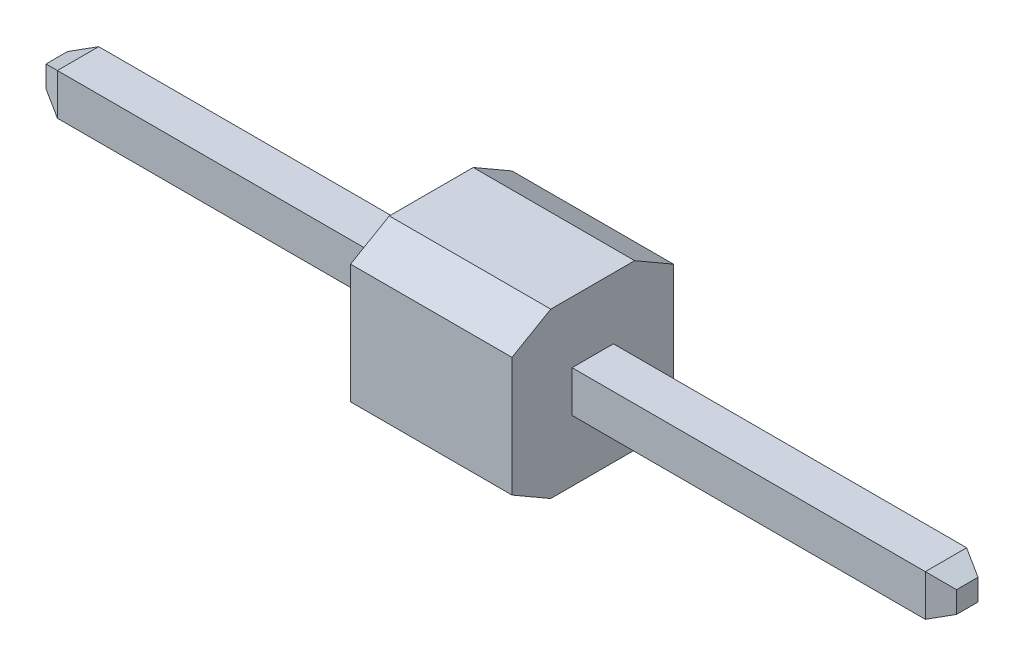
ISO-10303-21;
HEADER;
FILE_DESCRIPTION(('STEP AP214'),'2;1');
FILE_NAME('part.step','',(''),(''),'','','');
FILE_SCHEMA(('AUTOMOTIVE_DESIGN { 1 0 10303 214 1 1 1 1 }'));
ENDSEC;
DATA;
#1=APPLICATION_CONTEXT('core data for automotive mechanical design processes');
#2=APPLICATION_PROTOCOL_DEFINITION('international standard','automotive_design',2000,#1);
#3=PRODUCT_CONTEXT('',#1,'mechanical');
#4=PRODUCT('Part','Part','',(#3));
#5=PRODUCT_RELATED_PRODUCT_CATEGORY('part','',(#4));
#6=PRODUCT_DEFINITION_FORMATION('','',#4);
#7=PRODUCT_DEFINITION_CONTEXT('part definition',#1,'design');
#8=PRODUCT_DEFINITION('design','',#6,#7);
#9=PRODUCT_DEFINITION_SHAPE('','',#8);
#10=(LENGTH_UNIT() NAMED_UNIT(*) SI_UNIT(.MILLI.,.METRE.));
#11=(NAMED_UNIT(*) PLANE_ANGLE_UNIT() SI_UNIT($,.RADIAN.));
#12=(NAMED_UNIT(*) SI_UNIT($,.STERADIAN.) SOLID_ANGLE_UNIT());
#13=UNCERTAINTY_MEASURE_WITH_UNIT(LENGTH_MEASURE(1.E-05),#10,'distance_accuracy_value','');
#14=(GEOMETRIC_REPRESENTATION_CONTEXT(3) GLOBAL_UNCERTAINTY_ASSIGNED_CONTEXT((#13)) GLOBAL_UNIT_ASSIGNED_CONTEXT((#10,
#11,#12)) REPRESENTATION_CONTEXT('',''));
#15=CARTESIAN_POINT('',(0.,0.,0.));
#16=DIRECTION('',(0.,0.,1.));
#17=DIRECTION('',(1.,0.,0.));
#18=AXIS2_PLACEMENT_3D('',#15,#16,#17);
#19=CARTESIAN_POINT('',(5.42107666149886,10.4771157260571,-2.77112148378018));
#20=DIRECTION('',(1.,-9.93476518829084E-08,4.37113882867379E-08));
#21=DIRECTION('',(-9.93476589883358E-08,-1.,8.74227765734759E-08));
#22=AXIS2_PLACEMENT_3D('',#19,#20,#21);
#23=PLANE('',#22);
#24=DIRECTION('',(-1.18186619959584E-08,-0.50000007571054,-0.866025360072934));
#25=VECTOR('',#24,1.);
#26=CARTESIAN_POINT('',(5.42107646932425,9.23352602482091,-1.2011213750621));
#27=LINE('',#26,#25);
#28=CARTESIAN_POINT('',(5.42107646932425,9.23352602482091,-1.2011213750621));
#29=VERTEX_POINT('',#28);
#30=CARTESIAN_POINT('',(5.42107646113604,8.88711581085724,-1.80112134477796));
#31=VERTEX_POINT('',#30);
#32=EDGE_CURVE('E11',#29,#31,#27,.T.);
#33=ORIENTED_EDGE('',*,*,#32,.T.);
#34=DIRECTION('',(4.37113811813104E-08,-8.74227842254741E-08,-0.999999999999995));
#35=VECTOR('',#34,1.);
#36=CARTESIAN_POINT('',(5.42107646113604,8.88711581085724,-1.80112134477796));
#37=LINE('',#36,#35);
#38=CARTESIAN_POINT('',(5.42107651796084,8.88711569720762,-3.10112134477796));
#39=VERTEX_POINT('',#38);
#40=EDGE_CURVE('E304',#31,#39,#37,.T.);
#41=ORIENTED_EDGE('',*,*,#40,.T.);
#42=DIRECTION('',(8.75289950712042E-08,0.499999924289839,-0.866025447495712));
#43=VECTOR('',#42,1.);
#44=CARTESIAN_POINT('',(5.42107651796084,8.88711569720762,-3.10112134477796));
#45=LINE('',#44,#43);
#46=CARTESIAN_POINT('',(5.42107657860271,9.23352580626395,-3.7011213750621));
#47=VERTEX_POINT('',#46);
#48=EDGE_CURVE('E296',#39,#47,#45,.T.);
#49=ORIENTED_EDGE('',*,*,#48,.T.);
#50=DIRECTION('',(9.93476593244772E-08,0.999999999999991,-8.74227767226935E-08));
#51=VECTOR('',#50,1.);
#52=CARTESIAN_POINT('',(5.42107657860271,9.23352580626395,-3.7011213750621));
#53=LINE('',#52,#51);
#54=CARTESIAN_POINT('',(5.42107676211568,11.080705483234,-3.70112153654768));
#55=VERTEX_POINT('',#54);
#56=EDGE_CURVE('E281',#47,#55,#53,.T.);
#57=ORIENTED_EDGE('',*,*,#56,.T.);
#58=DIRECTION('',(-1.18186619958732E-08,-0.500000075710534,-0.866025360072937));
#59=VECTOR('',#58,1.);
#60=CARTESIAN_POINT('',(5.42107677030389,11.4271156972076,-3.10112156683181));
#61=LINE('',#60,#59);
#62=CARTESIAN_POINT('',(5.42107677030389,11.4271156972076,-3.10112156683181));
#63=VERTEX_POINT('',#62);
#64=EDGE_CURVE('E265',#63,#55,#61,.T.);
#65=ORIENTED_EDGE('',*,*,#64,.F.);
#66=DIRECTION('',(4.37113811813104E-08,-8.74227842254741E-08,-0.999999999999995));
#67=VECTOR('',#66,1.);
#68=CARTESIAN_POINT('',(5.4210767134791,11.4271158108572,-1.80112156683181));
#69=LINE('',#68,#67);
#70=CARTESIAN_POINT('',(5.4210767134791,11.4271158108572,-1.80112156683181));
#71=VERTEX_POINT('',#70);
#72=EDGE_CURVE('E248',#71,#63,#69,.T.);
#73=ORIENTED_EDGE('',*,*,#72,.F.);
#74=DIRECTION('',(8.7528995070573E-08,0.499999924289833,-0.866025447495715));
#75=VECTOR('',#74,1.);
#76=CARTESIAN_POINT('',(5.42107665283723,11.0807057017909,-1.20112153654768));
#77=LINE('',#76,#75);
#78=CARTESIAN_POINT('',(5.42107665283723,11.0807057017909,-1.20112153654768));
#79=VERTEX_POINT('',#78);
#80=EDGE_CURVE('E242',#79,#71,#77,.T.);
#81=ORIENTED_EDGE('',*,*,#80,.F.);
#82=DIRECTION('',(9.93476593244772E-08,0.999999999999991,-8.74227763620714E-08));
#83=VECTOR('',#82,1.);
#84=CARTESIAN_POINT('',(5.42107646932425,9.23352602482091,-1.2011213750621));
#85=LINE('',#84,#83);
#86=EDGE_CURVE('E236',#29,#79,#85,.T.);
#87=ORIENTED_EDGE('',*,*,#86,.F.);
#88=EDGE_LOOP('',(#33,#41,#49,#57,#65,#73,#81,#87));
#89=FACE_BOUND('',#88,.T.);
#90=DIRECTION('',(-4.37113803486431E-08,8.74227856773043E-08,0.999999999999995));
#91=VECTOR('',#90,1.);
#92=CARTESIAN_POINT('',(5.42107659791636,9.83711572605714,-2.7711214278296));
#93=LINE('',#92,#91);
#94=CARTESIAN_POINT('',(5.42107659791636,9.83711572605714,-2.7711214278296));
#95=VERTEX_POINT('',#94);
#96=CARTESIAN_POINT('',(5.42107656994108,9.83711578200772,-2.1311214278296));
#97=VERTEX_POINT('',#96);
#98=EDGE_CURVE('E302',#95,#97,#93,.T.);
#99=ORIENTED_EDGE('',*,*,#98,.T.);
#100=DIRECTION('',(-9.93476592658906E-08,-0.999999999999991,8.74227759628524E-08));
#101=VECTOR('',#100,1.);
#102=CARTESIAN_POINT('',(5.42107663352358,10.4771157820077,-2.13112148378018));
#103=LINE('',#102,#101);
#104=CARTESIAN_POINT('',(5.42107663352358,10.4771157820077,-2.13112148378018));
#105=VERTEX_POINT('',#104);
#106=EDGE_CURVE('E293',#105,#97,#103,.T.);
#107=ORIENTED_EDGE('',*,*,#106,.F.);
#108=DIRECTION('',(-4.37113803486431E-08,8.74227856773042E-08,0.999999999999995));
#109=VECTOR('',#108,1.);
#110=CARTESIAN_POINT('',(5.42107666149886,10.4771157260571,-2.77112148378018));
#111=LINE('',#110,#109);
#112=CARTESIAN_POINT('',(5.42107666149886,10.4771157260571,-2.77112148378018));
#113=VERTEX_POINT('',#112);
#114=EDGE_CURVE('E278',#113,#105,#111,.T.);
#115=ORIENTED_EDGE('',*,*,#114,.F.);
#116=DIRECTION('',(-9.93476592658906E-08,-0.999999999999991,8.74227766567418E-08));
#117=VECTOR('',#116,1.);
#118=CARTESIAN_POINT('',(5.42107666149886,10.4771157260571,-2.77112148378018));
#119=LINE('',#118,#117);
#120=EDGE_CURVE('E263',#113,#95,#119,.T.);
#121=ORIENTED_EDGE('',*,*,#120,.T.);
#122=EDGE_LOOP('',(#99,#107,#115,#121));
#123=FACE_BOUND('',#122,.T.);
#124=ADVANCED_FACE('F17',(#89,#123),#23,.T.);
#125=CARTESIAN_POINT('',(2.92107666149886,10.4771159744263,-2.77112159305865));
#126=DIRECTION('',(1.,-9.93476518829084E-08,4.37113882867379E-08));
#127=DIRECTION('',(-9.93476589883358E-08,-1.,8.74227765734759E-08));
#128=AXIS2_PLACEMENT_3D('',#125,#126,#127);
#129=PLANE('',#128);
#130=DIRECTION('',(-1.18186632779335E-08,-0.50000007571054,-0.866025360072934));
#131=VECTOR('',#130,1.);
#132=CARTESIAN_POINT('',(2.92107646932425,9.23352627319004,-1.20112148434057));
#133=LINE('',#132,#131);
#134=CARTESIAN_POINT('',(2.92107646932425,9.23352627319004,-1.20112148434057));
#135=VERTEX_POINT('',#134);
#136=CARTESIAN_POINT('',(2.92107646113604,8.88711605922637,-1.80112145405643));
#137=VERTEX_POINT('',#136);
#138=EDGE_CURVE('E24',#135,#137,#133,.T.);
#139=ORIENTED_EDGE('',*,*,#138,.F.);
#140=DIRECTION('',(9.93476588436478E-08,0.999999999999991,-8.74227763620714E-08));
#141=VECTOR('',#140,1.);
#142=CARTESIAN_POINT('',(2.92107646932425,9.23352627319004,-1.20112148434057));
#143=LINE('',#142,#141);
#144=CARTESIAN_POINT('',(2.92107665283723,11.08070595016,-1.20112164582615));
#145=VERTEX_POINT('',#144);
#146=EDGE_CURVE('E300',#135,#145,#143,.T.);
#147=ORIENTED_EDGE('',*,*,#146,.T.);
#148=DIRECTION('',(8.75289963525482E-08,0.499999924289833,-0.866025447495715));
#149=VECTOR('',#148,1.);
#150=CARTESIAN_POINT('',(2.92107665283723,11.08070595016,-1.20112164582615));
#151=LINE('',#150,#149);
#152=CARTESIAN_POINT('',(2.9210767134791,11.4271160592264,-1.80112167611028));
#153=VERTEX_POINT('',#152);
#154=EDGE_CURVE('E286',#145,#153,#151,.T.);
#155=ORIENTED_EDGE('',*,*,#154,.T.);
#156=DIRECTION('',(4.37113811813104E-08,-8.74227842254741E-08,-0.999999999999995));
#157=VECTOR('',#156,1.);
#158=CARTESIAN_POINT('',(2.9210767134791,11.4271160592264,-1.80112167611028));
#159=LINE('',#158,#157);
#160=CARTESIAN_POINT('',(2.92107677030389,11.4271159455767,-3.10112167611028));
#161=VERTEX_POINT('',#160);
#162=EDGE_CURVE('E271',#153,#161,#159,.T.);
#163=ORIENTED_EDGE('',*,*,#162,.T.);
#164=DIRECTION('',(-1.18186632778483E-08,-0.500000075710534,-0.866025360072937));
#165=VECTOR('',#164,1.);
#166=CARTESIAN_POINT('',(2.92107677030389,11.4271159455767,-3.10112167611028));
#167=LINE('',#166,#165);
#168=CARTESIAN_POINT('',(2.92107676211568,11.0807057316031,-3.70112164582615));
#169=VERTEX_POINT('',#168);
#170=EDGE_CURVE('E253',#161,#169,#167,.T.);
#171=ORIENTED_EDGE('',*,*,#170,.T.);
#172=DIRECTION('',(9.93476588436478E-08,0.999999999999991,-8.74227767226935E-08));
#173=VECTOR('',#172,1.);
#174=CARTESIAN_POINT('',(2.92107657860271,9.23352605463308,-3.70112148434057));
#175=LINE('',#174,#173);
#176=CARTESIAN_POINT('',(2.92107657860271,9.23352605463308,-3.70112148434057));
#177=VERTEX_POINT('',#176);
#178=EDGE_CURVE('E261',#177,#169,#175,.T.);
#179=ORIENTED_EDGE('',*,*,#178,.F.);
#180=DIRECTION('',(8.75289963531793E-08,0.499999924289839,-0.866025447495712));
#181=VECTOR('',#180,1.);
#182=CARTESIAN_POINT('',(2.92107651796084,8.88711594557675,-3.10112145405643));
#183=LINE('',#182,#181);
#184=CARTESIAN_POINT('',(2.92107651796084,8.88711594557675,-3.10112145405643));
#185=VERTEX_POINT('',#184);
#186=EDGE_CURVE('E276',#185,#177,#183,.T.);
#187=ORIENTED_EDGE('',*,*,#186,.F.);
#188=DIRECTION('',(4.37113811813104E-08,-8.74227842254741E-08,-0.999999999999995));
#189=VECTOR('',#188,1.);
#190=CARTESIAN_POINT('',(2.92107646113604,8.88711605922637,-1.80112145405643));
#191=LINE('',#190,#189);
#192=EDGE_CURVE('E291',#137,#185,#191,.T.);
#193=ORIENTED_EDGE('',*,*,#192,.F.);
#194=EDGE_LOOP('',(#139,#147,#155,#163,#171,#179,#187,#193));
#195=FACE_BOUND('',#194,.T.);
#196=DIRECTION('',(-9.93476585720012E-08,-0.999999999999991,8.74227759628524E-08));
#197=VECTOR('',#196,1.);
#198=CARTESIAN_POINT('',(2.92107663352358,10.4771160303769,-2.13112159305865));
#199=LINE('',#198,#197);
#200=CARTESIAN_POINT('',(2.92107663352358,10.4771160303769,-2.13112159305865));
#201=VERTEX_POINT('',#200);
#202=CARTESIAN_POINT('',(2.92107656994108,9.83711603037685,-2.13112153710807));
#203=VERTEX_POINT('',#202);
#204=EDGE_CURVE('E298',#201,#203,#199,.T.);
#205=ORIENTED_EDGE('',*,*,#204,.T.);
#206=DIRECTION('',(-4.37113810425325E-08,8.74227856773043E-08,0.999999999999995));
#207=VECTOR('',#206,1.);
#208=CARTESIAN_POINT('',(2.92107659791636,9.83711597442627,-2.77112153710807));
#209=LINE('',#208,#207);
#210=CARTESIAN_POINT('',(2.92107659791636,9.83711597442627,-2.77112153710807));
#211=VERTEX_POINT('',#210);
#212=EDGE_CURVE('E283',#211,#203,#209,.T.);
#213=ORIENTED_EDGE('',*,*,#212,.F.);
#214=DIRECTION('',(-9.93476585720012E-08,-0.999999999999991,8.74227766567418E-08));
#215=VECTOR('',#214,1.);
#216=CARTESIAN_POINT('',(2.92107666149886,10.4771159744263,-2.77112159305865));
#217=LINE('',#216,#215);
#218=CARTESIAN_POINT('',(2.92107666149886,10.4771159744263,-2.77112159305865));
#219=VERTEX_POINT('',#218);
#220=EDGE_CURVE('E268',#219,#211,#217,.T.);
#221=ORIENTED_EDGE('',*,*,#220,.F.);
#222=DIRECTION('',(-4.37113810425325E-08,8.74227856773042E-08,0.999999999999995));
#223=VECTOR('',#222,1.);
#224=CARTESIAN_POINT('',(2.92107666149886,10.4771159744263,-2.77112159305865));
#225=LINE('',#224,#223);
#226=EDGE_CURVE('E251',#219,#201,#225,.T.);
#227=ORIENTED_EDGE('',*,*,#226,.T.);
#228=EDGE_LOOP('',(#205,#213,#221,#227));
#229=FACE_BOUND('',#228,.T.);
#230=ADVANCED_FACE('F314',(#195,#229),#129,.F.);
#231=CARTESIAN_POINT('',(5.42107646932425,9.23352602482091,-1.2011213750621));
#232=DIRECTION('',(1.07893287081065E-07,0.866025360072937,-0.500000075710535));
#233=DIRECTION('',(1.18186629566715E-08,0.500000075710542,0.866025360072941));
#234=AXIS2_PLACEMENT_3D('',#231,#232,#233);
#235=PLANE('',#234);
#236=ORIENTED_EDGE('',*,*,#138,.T.);
#237=DIRECTION('',(-0.999999999999994,9.93476504618223E-08,-4.37113884643734E-08));
#238=VECTOR('',#237,1.);
#239=CARTESIAN_POINT('',(5.42107646113604,8.88711581085724,-1.80112134477796));
#240=LINE('',#239,#238);
#241=EDGE_CURVE('E288',#31,#137,#240,.T.);
#242=ORIENTED_EDGE('',*,*,#241,.F.);
#243=ORIENTED_EDGE('',*,*,#32,.F.);
#244=DIRECTION('',(-0.999999999999994,9.93476533039933E-08,-4.3711388109102E-08));
#245=VECTOR('',#244,1.);
#246=CARTESIAN_POINT('',(5.42107646932425,9.23352602482091,-1.2011213750621));
#247=LINE('',#246,#245);
#248=EDGE_CURVE('E256',#29,#135,#247,.T.);
#249=ORIENTED_EDGE('',*,*,#248,.T.);
#250=EDGE_LOOP('',(#236,#242,#243,#249));
#251=FACE_BOUND('',#250,.T.);
#252=ADVANCED_FACE('F306',(#251),#235,.F.);
#253=CARTESIAN_POINT('',(5.42107646113604,8.88711581085724,-1.80112134477796));
#254=DIRECTION('',(9.93476589883358E-08,1.,-8.74227765734759E-08));
#255=DIRECTION('',(1.,-9.93476518829084E-08,4.37113882867379E-08));
#256=AXIS2_PLACEMENT_3D('',#253,#254,#255);
#257=PLANE('',#256);
#258=ORIENTED_EDGE('',*,*,#192,.T.);
#259=DIRECTION('',(-0.999999999999994,9.93476504618223E-08,-4.37113882867377E-08));
#260=VECTOR('',#259,1.);
#261=CARTESIAN_POINT('',(5.42107651796084,8.88711569720762,-3.10112134477796));
#262=LINE('',#261,#260);
#263=EDGE_CURVE('E273',#39,#185,#262,.T.);
#264=ORIENTED_EDGE('',*,*,#263,.F.);
#265=ORIENTED_EDGE('',*,*,#40,.F.);
#266=ORIENTED_EDGE('',*,*,#241,.T.);
#267=EDGE_LOOP('',(#258,#264,#265,#266));
#268=FACE_BOUND('',#267,.T.);
#269=ADVANCED_FACE('F311',(#268),#257,.F.);
#270=CARTESIAN_POINT('',(5.42107651796084,8.88711569720762,-3.10112134477796));
#271=DIRECTION('',(6.41819058997377E-08,0.866025447495721,0.499999924289845));
#272=DIRECTION('',(-8.7528996031702E-08,-0.499999924289838,0.866025447495717));
#273=AXIS2_PLACEMENT_3D('',#270,#271,#272);
#274=PLANE('',#273);
#275=ORIENTED_EDGE('',*,*,#186,.T.);
#276=DIRECTION('',(-0.999999999999994,9.93476533039933E-08,-4.37113884643734E-08));
#277=VECTOR('',#276,1.);
#278=CARTESIAN_POINT('',(5.42107657860271,9.23352580626395,-3.7011213750621));
#279=LINE('',#278,#277);
#280=EDGE_CURVE('E258',#47,#177,#279,.T.);
#281=ORIENTED_EDGE('',*,*,#280,.F.);
#282=ORIENTED_EDGE('',*,*,#48,.F.);
#283=ORIENTED_EDGE('',*,*,#263,.T.);
#284=EDGE_LOOP('',(#275,#281,#282,#283));
#285=FACE_BOUND('',#284,.T.);
#286=ADVANCED_FACE('F319',(#285),#274,.F.);
#287=CARTESIAN_POINT('',(5.42107657860271,9.23352580626395,-3.7011213750621));
#288=DIRECTION('',(-4.37113811813106E-08,8.74227836789032E-08,1.));
#289=DIRECTION('',(-1.,9.93476518829084E-08,-4.37113882867379E-08));
#290=AXIS2_PLACEMENT_3D('',#287,#288,#289);
#291=PLANE('',#290);
#292=ORIENTED_EDGE('',*,*,#178,.T.);
#293=DIRECTION('',(-0.999999999999994,9.93476533039933E-08,-4.37113882867377E-08));
#294=VECTOR('',#293,1.);
#295=CARTESIAN_POINT('',(5.42107676211568,11.080705483234,-3.70112153654768));
#296=LINE('',#295,#294);
#297=EDGE_CURVE('E245',#55,#169,#296,.T.);
#298=ORIENTED_EDGE('',*,*,#297,.F.);
#299=ORIENTED_EDGE('',*,*,#56,.F.);
#300=ORIENTED_EDGE('',*,*,#280,.T.);
#301=EDGE_LOOP('',(#292,#298,#299,#300));
#302=FACE_BOUND('',#301,.T.);
#303=ADVANCED_FACE('F326',(#302),#291,.F.);
#304=CARTESIAN_POINT('',(5.42107677030389,11.4271156972076,-3.10112156683181));
#305=DIRECTION('',(1.07893287081065E-07,0.866025360072937,-0.500000075710535));
#306=DIRECTION('',(1.18186629566715E-08,0.500000075710542,0.866025360072941));
#307=AXIS2_PLACEMENT_3D('',#304,#305,#306);
#308=PLANE('',#307);
#309=ORIENTED_EDGE('',*,*,#170,.F.);
#310=DIRECTION('',(-0.999999999999994,9.93476533039933E-08,-4.37113884643734E-08));
#311=VECTOR('',#310,1.);
#312=CARTESIAN_POINT('',(5.42107677030389,11.4271156972076,-3.10112156683181));
#313=LINE('',#312,#311);
#314=EDGE_CURVE('E239',#63,#161,#313,.T.);
#315=ORIENTED_EDGE('',*,*,#314,.F.);
#316=ORIENTED_EDGE('',*,*,#64,.T.);
#317=ORIENTED_EDGE('',*,*,#297,.T.);
#318=EDGE_LOOP('',(#309,#315,#316,#317));
#319=FACE_BOUND('',#318,.T.);
#320=ADVANCED_FACE('F329',(#319),#308,.T.);
#321=CARTESIAN_POINT('',(5.4210767134791,11.4271158108572,-1.80112156683181));
#322=DIRECTION('',(9.93476589883358E-08,1.,-8.74227765734759E-08));
#323=DIRECTION('',(1.,-9.93476518829084E-08,4.37113882867379E-08));
#324=AXIS2_PLACEMENT_3D('',#321,#322,#323);
#325=PLANE('',#324);
#326=ORIENTED_EDGE('',*,*,#162,.F.);
#327=DIRECTION('',(-0.999999999999994,9.93476533039933E-08,-4.37113883755555E-08));
#328=VECTOR('',#327,1.);
#329=CARTESIAN_POINT('',(5.4210767134791,11.4271158108572,-1.80112156683181));
#330=LINE('',#329,#328);
#331=EDGE_CURVE('E233',#71,#153,#330,.T.);
#332=ORIENTED_EDGE('',*,*,#331,.F.);
#333=ORIENTED_EDGE('',*,*,#72,.T.);
#334=ORIENTED_EDGE('',*,*,#314,.T.);
#335=EDGE_LOOP('',(#326,#332,#333,#334));
#336=FACE_BOUND('',#335,.T.);
#337=ADVANCED_FACE('F333',(#336),#325,.T.);
#338=CARTESIAN_POINT('',(5.42107665283723,11.0807057017909,-1.20112153654768));
#339=DIRECTION('',(6.41819058997377E-08,0.866025447495721,0.499999924289845));
#340=DIRECTION('',(-8.7528996031702E-08,-0.499999924289838,0.866025447495717));
#341=AXIS2_PLACEMENT_3D('',#338,#339,#340);
#342=PLANE('',#341);
#343=ORIENTED_EDGE('',*,*,#154,.F.);
#344=DIRECTION('',(-0.999999999999994,9.93476533039933E-08,-4.3711388109102E-08));
#345=VECTOR('',#344,1.);
#346=CARTESIAN_POINT('',(5.42107665283723,11.0807057017909,-1.20112153654768));
#347=LINE('',#346,#345);
#348=EDGE_CURVE('E230',#79,#145,#347,.T.);
#349=ORIENTED_EDGE('',*,*,#348,.F.);
#350=ORIENTED_EDGE('',*,*,#80,.T.);
#351=ORIENTED_EDGE('',*,*,#331,.T.);
#352=EDGE_LOOP('',(#343,#349,#350,#351));
#353=FACE_BOUND('',#352,.T.);
#354=ADVANCED_FACE('F337',(#353),#342,.T.);
#355=CARTESIAN_POINT('',(5.42107646932425,9.23352602482091,-1.2011213750621));
#356=DIRECTION('',(-4.37113811813106E-08,8.74227835615132E-08,1.));
#357=DIRECTION('',(-9.93476589883358E-08,-1.,8.74227764560859E-08));
#358=AXIS2_PLACEMENT_3D('',#355,#356,#357);
#359=PLANE('',#358);
#360=ORIENTED_EDGE('',*,*,#146,.F.);
#361=ORIENTED_EDGE('',*,*,#248,.F.);
#362=ORIENTED_EDGE('',*,*,#86,.T.);
#363=ORIENTED_EDGE('',*,*,#348,.T.);
#364=EDGE_LOOP('',(#360,#361,#362,#363));
#365=FACE_BOUND('',#364,.T.);
#366=ADVANCED_FACE('F339',(#365),#359,.T.);
#367=CARTESIAN_POINT('',(-2.87892333850114,10.4771165506426,-2.7711218465847));
#368=DIRECTION('',(-1.,9.93476518829084E-08,-4.37113882867379E-08));
#369=DIRECTION('',(9.93476589883358E-08,1.,-8.74227765734759E-08));
#370=AXIS2_PLACEMENT_3D('',#367,#368,#369);
#371=PLANE('',#370);
#372=DIRECTION('',(9.93476608211201E-08,0.999999999999991,-8.74227774781761E-08));
#373=VECTOR('',#372,1.);
#374=CARTESIAN_POINT('',(-2.87892340804478,9.99099812033048,-2.28500333127787));
#375=LINE('',#374,#373);
#376=CARTESIAN_POINT('',(-2.87892340804478,9.99099812033048,-2.28500333127787));
#377=VERTEX_POINT('',#376);
#378=CARTESIAN_POINT('',(-2.87892337503782,10.3232350659405,-2.28500336032295));
#379=VERTEX_POINT('',#378);
#380=EDGE_CURVE('E228',#377,#379,#375,.T.);
#381=ORIENTED_EDGE('',*,*,#380,.T.);
#382=DIRECTION('',(4.37113820547149E-08,-8.7422774802743E-08,-0.999999999999995));
#383=VECTOR('',#382,1.);
#384=CARTESIAN_POINT('',(-2.87892337503782,10.3232350659405,-2.28500336032295));
#385=LINE('',#384,#383);
#386=CARTESIAN_POINT('',(-2.87892336051528,10.3232350368954,-2.61724030594095));
#387=VERTEX_POINT('',#386);
#388=EDGE_CURVE('E223',#379,#387,#385,.T.);
#389=ORIENTED_EDGE('',*,*,#388,.T.);
#390=DIRECTION('',(-9.93476608211201E-08,-0.999999999999991,8.7422776141512E-08));
#391=VECTOR('',#390,1.);
#392=CARTESIAN_POINT('',(-2.87892336051528,10.3232350368954,-2.61724030594095));
#393=LINE('',#392,#391);
#394=CARTESIAN_POINT('',(-2.87892339352224,9.9909980912854,-2.61724027689587));
#395=VERTEX_POINT('',#394);
#396=EDGE_CURVE('E215',#387,#395,#393,.T.);
#397=ORIENTED_EDGE('',*,*,#396,.T.);
#398=DIRECTION('',(-4.37113767080583E-08,8.74227854960559E-08,0.999999999999995));
#399=VECTOR('',#398,1.);
#400=CARTESIAN_POINT('',(-2.87892339352225,9.9909980912854,-2.61724027689587));
#401=LINE('',#400,#399);
#402=EDGE_CURVE('E207',#395,#377,#401,.T.);
#403=ORIENTED_EDGE('',*,*,#402,.T.);
#404=EDGE_LOOP('',(#381,#389,#397,#403));
#405=FACE_BOUND('',#404,.T.);
#406=ADVANCED_FACE('F341',(#405),#371,.T.);
#407=CARTESIAN_POINT('',(-2.87892333850114,10.4771165506426,-2.7711218465847));
#408=DIRECTION('',(9.93476589883358E-08,1.,-8.74227764510112E-08));
#409=DIRECTION('',(-4.37113811813106E-08,8.74227835564385E-08,1.));
#410=AXIS2_PLACEMENT_3D('',#407,#408,#409);
#411=PLANE('',#410);
#412=DIRECTION('',(0.999999999999994,-9.93476521037346E-08,4.37113882769953E-08));
#413=VECTOR('',#412,1.);
#414=CARTESIAN_POINT('',(-2.54892333850114,10.4771165178579,-2.77112183215994));
#415=LINE('',#414,#413);
#416=CARTESIAN_POINT('',(-2.54892333850114,10.4771165178579,-2.77112183215994));
#417=VERTEX_POINT('',#416);
#418=EDGE_CURVE('E225',#417,#219,#415,.T.);
#419=ORIENTED_EDGE('',*,*,#418,.F.);
#420=DIRECTION('',(-4.37113803486431E-08,8.74227856773042E-08,0.999999999999995));
#421=VECTOR('',#420,1.);
#422=CARTESIAN_POINT('',(-2.54892333850114,10.4771165178579,-2.77112183215994));
#423=LINE('',#422,#421);
#424=CARTESIAN_POINT('',(-2.54892336647642,10.4771165738085,-2.13112183215994));
#425=VERTEX_POINT('',#424);
#426=EDGE_CURVE('E217',#417,#425,#423,.T.);
#427=ORIENTED_EDGE('',*,*,#426,.T.);
#428=DIRECTION('',(0.999999999999994,-9.93476521037346E-08,4.3711388195809E-08));
#429=VECTOR('',#428,1.);
#430=CARTESIAN_POINT('',(-2.54892336647642,10.4771165738085,-2.13112183215994));
#431=LINE('',#430,#429);
#432=EDGE_CURVE('E220',#425,#201,#431,.T.);
#433=ORIENTED_EDGE('',*,*,#432,.T.);
#434=ORIENTED_EDGE('',*,*,#226,.F.);
#435=EDGE_LOOP('',(#419,#427,#433,#434));
#436=FACE_BOUND('',#435,.T.);
#437=ADVANCED_FACE('F348',(#436),#411,.T.);
#438=CARTESIAN_POINT('',(-2.87892336647642,10.4771166065932,-2.1311218465847));
#439=DIRECTION('',(-4.37113811813106E-08,8.74227836789032E-08,1.));
#440=DIRECTION('',(-1.,9.93476518829084E-08,-4.37113882867379E-08));
#441=AXIS2_PLACEMENT_3D('',#438,#439,#440);
#442=PLANE('',#441);
#443=ORIENTED_EDGE('',*,*,#432,.F.);
#444=DIRECTION('',(-9.93476592658906E-08,-0.999999999999991,8.74227766567418E-08));
#445=VECTOR('',#444,1.);
#446=CARTESIAN_POINT('',(-2.54892336647642,10.4771165738085,-2.13112183215994));
#447=LINE('',#446,#445);
#448=CARTESIAN_POINT('',(-2.54892343005892,9.83711657380851,-2.13112177620936));
#449=VERTEX_POINT('',#448);
#450=EDGE_CURVE('E209',#425,#449,#447,.T.);
#451=ORIENTED_EDGE('',*,*,#450,.T.);
#452=DIRECTION('',(0.999999999999994,-9.93476547016971E-08,4.3711388195809E-08));
#453=VECTOR('',#452,1.);
#454=CARTESIAN_POINT('',(-2.54892343005892,9.83711657380851,-2.13112177620936));
#455=LINE('',#454,#453);
#456=EDGE_CURVE('E212',#449,#203,#455,.T.);
#457=ORIENTED_EDGE('',*,*,#456,.T.);
#458=ORIENTED_EDGE('',*,*,#204,.F.);
#459=EDGE_LOOP('',(#443,#451,#457,#458));
#460=FACE_BOUND('',#459,.T.);
#461=ADVANCED_FACE('F424',(#460),#442,.T.);
#462=CARTESIAN_POINT('',(-2.87892340208364,9.83711655064265,-2.77112179063412));
#463=DIRECTION('',(9.93476589883357E-08,1.,-8.74227764040693E-08));
#464=DIRECTION('',(-4.37113811813106E-08,8.74227835094966E-08,1.));
#465=AXIS2_PLACEMENT_3D('',#462,#463,#464);
#466=PLANE('',#465);
#467=ORIENTED_EDGE('',*,*,#456,.F.);
#468=DIRECTION('',(4.37113817364219E-08,-8.74227967795345E-08,-0.999999999999995));
#469=VECTOR('',#468,1.);
#470=CARTESIAN_POINT('',(-2.54892343005892,9.83711657380852,-2.13112177620936));
#471=LINE('',#470,#469);
#472=CARTESIAN_POINT('',(-2.54892340208364,9.83711651785792,-2.77112177620936));
#473=VERTEX_POINT('',#472);
#474=EDGE_CURVE('E201',#449,#473,#471,.T.);
#475=ORIENTED_EDGE('',*,*,#474,.T.);
#476=DIRECTION('',(0.999999999999994,-9.93476547016971E-08,4.37113882769953E-08));
#477=VECTOR('',#476,1.);
#478=CARTESIAN_POINT('',(-2.54892340208364,9.83711651785792,-2.77112177620936));
#479=LINE('',#478,#477);
#480=EDGE_CURVE('E204',#473,#211,#479,.T.);
#481=ORIENTED_EDGE('',*,*,#480,.T.);
#482=ORIENTED_EDGE('',*,*,#212,.T.);
#483=EDGE_LOOP('',(#467,#475,#481,#482));
#484=FACE_BOUND('',#483,.T.);
#485=ADVANCED_FACE('F421',(#484),#466,.F.);
#486=CARTESIAN_POINT('',(-2.87892333850114,10.4771165506426,-2.7711218465847));
#487=DIRECTION('',(-4.37113811813106E-08,8.74227836789032E-08,1.));
#488=DIRECTION('',(-1.,9.93476518829084E-08,-4.37113882867379E-08));
#489=AXIS2_PLACEMENT_3D('',#486,#487,#488);
#490=PLANE('',#489);
#491=ORIENTED_EDGE('',*,*,#480,.F.);
#492=DIRECTION('',(9.93476578781123E-08,0.999999999999991,-8.74227766567422E-08));
#493=VECTOR('',#492,1.);
#494=CARTESIAN_POINT('',(-2.54892340208364,9.83711651785793,-2.77112177620936));
#495=LINE('',#494,#493);
#496=EDGE_CURVE('E196',#473,#417,#495,.T.);
#497=ORIENTED_EDGE('',*,*,#496,.T.);
#498=ORIENTED_EDGE('',*,*,#418,.T.);
#499=ORIENTED_EDGE('',*,*,#220,.T.);
#500=EDGE_LOOP('',(#491,#497,#498,#499));
#501=FACE_BOUND('',#500,.T.);
#502=ADVANCED_FACE('F376',(#501),#490,.F.);
#503=CARTESIAN_POINT('',(-2.87892333850114,10.4771165506426,-2.7711218465847));
#504=DIRECTION('',(-4.37113811813106E-08,8.74227836789032E-08,1.));
#505=DIRECTION('',(-1.,9.93476518829084E-08,-4.37113882867379E-08));
#506=AXIS2_PLACEMENT_3D('',#503,#504,#505);
#507=PLANE('',#506);
#508=DIRECTION('',(0.999999999999994,-9.93476469078097E-08,4.37113882769953E-08));
#509=VECTOR('',#508,1.);
#510=CARTESIAN_POINT('',(5.42107666149886,10.4771157260571,-2.77112148378018));
#511=LINE('',#510,#509);
#512=CARTESIAN_POINT('',(10.8910766614989,10.4771151826255,-2.77112124467888));
#513=VERTEX_POINT('',#512);
#514=EDGE_CURVE('E199',#113,#513,#511,.T.);
#515=ORIENTED_EDGE('',*,*,#514,.T.);
#516=DIRECTION('',(-9.93476606536693E-08,-0.999999999999991,8.74227766567418E-08));
#517=VECTOR('',#516,1.);
#518=CARTESIAN_POINT('',(10.8910766614989,10.4771151826255,-2.77112124467888));
#519=LINE('',#518,#517);
#520=CARTESIAN_POINT('',(10.8910765979164,9.83711518262548,-2.77112118872831));
#521=VERTEX_POINT('',#520);
#522=EDGE_CURVE('E191',#513,#521,#519,.T.);
#523=ORIENTED_EDGE('',*,*,#522,.T.);
#524=DIRECTION('',(0.999999999999994,-9.93476572996596E-08,4.37113882769953E-08));
#525=VECTOR('',#524,1.);
#526=CARTESIAN_POINT('',(5.42107659791636,9.83711572605714,-2.7711214278296));
#527=LINE('',#526,#525);
#528=EDGE_CURVE('E194',#95,#521,#527,.T.);
#529=ORIENTED_EDGE('',*,*,#528,.F.);
#530=ORIENTED_EDGE('',*,*,#120,.F.);
#531=EDGE_LOOP('',(#515,#523,#529,#530));
#532=FACE_BOUND('',#531,.T.);
#533=ADVANCED_FACE('F367',(#532),#507,.F.);
#534=CARTESIAN_POINT('',(-2.87892340208364,9.83711655064265,-2.77112179063412));
#535=DIRECTION('',(9.93476589883357E-08,1.,-8.74227764040693E-08));
#536=DIRECTION('',(-4.37113811813106E-08,8.74227835094966E-08,1.));
#537=AXIS2_PLACEMENT_3D('',#534,#535,#536);
#538=PLANE('',#537);
#539=ORIENTED_EDGE('',*,*,#528,.T.);
#540=DIRECTION('',(-4.37113845119794E-08,8.74227856773042E-08,0.999999999999995));
#541=VECTOR('',#540,1.);
#542=CARTESIAN_POINT('',(10.8910765979164,9.83711518262548,-2.77112118872831));
#543=LINE('',#542,#541);
#544=CARTESIAN_POINT('',(10.8910765699411,9.83711523857606,-2.13112118872831));
#545=VERTEX_POINT('',#544);
#546=EDGE_CURVE('E186',#521,#545,#543,.T.);
#547=ORIENTED_EDGE('',*,*,#546,.T.);
#548=DIRECTION('',(0.999999999999994,-9.93476572996596E-08,4.37113881146227E-08));
#549=VECTOR('',#548,1.);
#550=CARTESIAN_POINT('',(5.42107656994108,9.83711578200772,-2.1311214278296));
#551=LINE('',#550,#549);
#552=EDGE_CURVE('E189',#97,#545,#551,.T.);
#553=ORIENTED_EDGE('',*,*,#552,.F.);
#554=ORIENTED_EDGE('',*,*,#98,.F.);
#555=EDGE_LOOP('',(#539,#547,#553,#554));
#556=FACE_BOUND('',#555,.T.);
#557=ADVANCED_FACE('F364',(#556),#538,.F.);
#558=CARTESIAN_POINT('',(-2.87892336647642,10.4771166065932,-2.1311218465847));
#559=DIRECTION('',(-4.37113811813106E-08,8.74227836789032E-08,1.));
#560=DIRECTION('',(-1.,9.93476518829084E-08,-4.37113882867379E-08));
#561=AXIS2_PLACEMENT_3D('',#558,#559,#560);
#562=PLANE('',#561);
#563=ORIENTED_EDGE('',*,*,#552,.T.);
#564=DIRECTION('',(9.93476606536699E-08,0.999999999999991,-8.74227759628529E-08));
#565=VECTOR('',#564,1.);
#566=CARTESIAN_POINT('',(10.8910765699411,9.83711523857607,-2.13112118872831));
#567=LINE('',#566,#565);
#568=CARTESIAN_POINT('',(10.8910766335236,10.4771152385761,-2.13112124467888));
#569=VERTEX_POINT('',#568);
#570=EDGE_CURVE('E176',#545,#569,#567,.T.);
#571=ORIENTED_EDGE('',*,*,#570,.T.);
#572=DIRECTION('',(0.999999999999994,-9.93476469078097E-08,4.37113881146227E-08));
#573=VECTOR('',#572,1.);
#574=CARTESIAN_POINT('',(5.42107663352358,10.4771157820077,-2.13112148378018));
#575=LINE('',#574,#573);
#576=EDGE_CURVE('E179',#105,#569,#575,.T.);
#577=ORIENTED_EDGE('',*,*,#576,.F.);
#578=ORIENTED_EDGE('',*,*,#106,.T.);
#579=EDGE_LOOP('',(#563,#571,#577,#578));
#580=FACE_BOUND('',#579,.T.);
#581=ADVANCED_FACE('F366',(#580),#562,.T.);
#582=CARTESIAN_POINT('',(-2.87892333850114,10.4771165506426,-2.7711218465847));
#583=DIRECTION('',(9.93476589883358E-08,1.,-8.74227764510112E-08));
#584=DIRECTION('',(-4.37113811813106E-08,8.74227835564385E-08,1.));
#585=AXIS2_PLACEMENT_3D('',#582,#583,#584);
#586=PLANE('',#585);
#587=ORIENTED_EDGE('',*,*,#576,.T.);
#588=DIRECTION('',(4.37113789608643E-08,-8.74227856773042E-08,-0.999999999999995));
#589=VECTOR('',#588,1.);
#590=CARTESIAN_POINT('',(10.8910766335236,10.4771152385761,-2.13112124467888));
#591=LINE('',#590,#589);
#592=EDGE_CURVE('E167',#569,#513,#591,.T.);
#593=ORIENTED_EDGE('',*,*,#592,.T.);
#594=ORIENTED_EDGE('',*,*,#514,.F.);
#595=ORIENTED_EDGE('',*,*,#114,.T.);
#596=EDGE_LOOP('',(#587,#593,#594,#595));
#597=FACE_BOUND('',#596,.T.);
#598=ADVANCED_FACE('F373',(#597),#586,.T.);
#599=CARTESIAN_POINT('',(11.2210766614989,10.4771151498408,-2.77112123025412));
#600=DIRECTION('',(-1.,9.93476518829084E-08,-4.37113882867379E-08));
#601=DIRECTION('',(9.93476589883358E-08,1.,-8.74227765734759E-08));
#602=AXIS2_PLACEMENT_3D('',#599,#600,#601);
#603=PLANE('',#602);
#604=DIRECTION('',(-9.93476581477919E-08,-0.999999999999991,8.7422776141512E-08));
#605=VECTOR('',#604,1.);
#606=CARTESIAN_POINT('',(11.2210766249622,10.3232336651386,-2.28500274399237));
#607=LINE('',#606,#605);
#608=CARTESIAN_POINT('',(11.2210766249622,10.3232336651386,-2.28500274399237));
#609=VERTEX_POINT('',#608);
#610=CARTESIAN_POINT('',(11.2210765919552,9.99099671952859,-2.2850027149473));
#611=VERTEX_POINT('',#610);
#612=EDGE_CURVE('E153',#609,#611,#607,.T.);
#613=ORIENTED_EDGE('',*,*,#612,.T.);
#614=DIRECTION('',(4.37113767080584E-08,-8.74228068826822E-08,-0.999999999999995));
#615=VECTOR('',#614,1.);
#616=CARTESIAN_POINT('',(11.2210765919552,9.9909967195286,-2.2850027149473));
#617=LINE('',#616,#615);
#618=CARTESIAN_POINT('',(11.2210766064778,9.99099669048351,-2.6172396605653));
#619=VERTEX_POINT('',#618);
#620=EDGE_CURVE('E395',#611,#619,#617,.T.);
#621=ORIENTED_EDGE('',*,*,#620,.T.);
#622=DIRECTION('',(9.93476581477919E-08,0.999999999999991,-8.7422776141512E-08));
#623=VECTOR('',#622,1.);
#624=CARTESIAN_POINT('',(11.2210766064778,9.99099669048351,-2.6172396605653));
#625=LINE('',#624,#623);
#626=CARTESIAN_POINT('',(11.2210766394847,10.3232336360935,-2.61723968961037));
#627=VERTEX_POINT('',#626);
#628=EDGE_CURVE('E156',#619,#627,#625,.T.);
#629=ORIENTED_EDGE('',*,*,#628,.T.);
#630=DIRECTION('',(-4.37113820547149E-08,8.7422774802743E-08,0.999999999999995));
#631=VECTOR('',#630,1.);
#632=CARTESIAN_POINT('',(11.2210766394847,10.3232336360935,-2.61723968961037));
#633=LINE('',#632,#631);
#634=EDGE_CURVE('E149',#627,#609,#633,.T.);
#635=ORIENTED_EDGE('',*,*,#634,.T.);
#636=EDGE_LOOP('',(#613,#621,#629,#635));
#637=FACE_BOUND('',#636,.T.);
#638=ADVANCED_FACE('F151',(#637),#603,.F.);
#639=CARTESIAN_POINT('',(-2.87892338679587,9.99099807783265,-2.77112180408687));
#640=DIRECTION('',(-0.422618351780369,-0.906307745050466,6.07587120833484E-08));
#641=DIRECTION('',(4.37113811813106E-08,-8.74227835094966E-08,-1.));
#642=AXIS2_PLACEMENT_3D('',#639,#640,#641);
#643=PLANE('',#642);
#644=DIRECTION('',(0.834817073788752,-0.389281669540032,0.3892816911581));
#645=VECTOR('',#644,1.);
#646=CARTESIAN_POINT('',(-2.8789234080448,9.99099812032996,-2.28500333127836));
#647=LINE('',#646,#645);
#648=EDGE_CURVE('E181',#377,#449,#647,.T.);
#649=ORIENTED_EDGE('',*,*,#648,.F.);
#650=ORIENTED_EDGE('',*,*,#402,.F.);
#651=DIRECTION('',(-0.834817107820826,0.389281737604198,0.389281550111906));
#652=VECTOR('',#651,1.);
#653=CARTESIAN_POINT('',(-2.54892340208407,9.83711651785646,-2.77112177620883));
#654=LINE('',#653,#652);
#655=EDGE_CURVE('E404',#473,#395,#654,.T.);
#656=ORIENTED_EDGE('',*,*,#655,.F.);
#657=ORIENTED_EDGE('',*,*,#474,.F.);
#658=EDGE_LOOP('',(#649,#650,#656,#657));
#659=FACE_BOUND('',#658,.T.);
#660=ADVANCED_FACE('F418',(#659),#643,.T.);
#661=CARTESIAN_POINT('',(-2.87892334522751,10.4771165640954,-2.6172403193937));
#662=DIRECTION('',(-0.422618222124847,-3.72458176658199E-08,-0.906307805509828));
#663=DIRECTION('',(9.93476589883358E-08,1.,-8.74227765734759E-08));
#664=AXIS2_PLACEMENT_3D('',#661,#662,#663);
#665=PLANE('',#664);
#666=ORIENTED_EDGE('',*,*,#655,.T.);
#667=ORIENTED_EDGE('',*,*,#396,.F.);
#668=DIRECTION('',(-0.834817185169254,-0.389281503665803,0.389281618176064));
#669=VECTOR('',#668,1.);
#670=CARTESIAN_POINT('',(-2.54892333849999,10.4771165178552,-2.77112183216021));
#671=LINE('',#670,#669);
#672=EDGE_CURVE('E160',#417,#387,#671,.T.);
#673=ORIENTED_EDGE('',*,*,#672,.F.);
#674=ORIENTED_EDGE('',*,*,#496,.F.);
#675=EDGE_LOOP('',(#666,#667,#673,#674));
#676=FACE_BOUND('',#675,.T.);
#677=ADVANCED_FACE('F434',(#676),#665,.T.);
#678=CARTESIAN_POINT('',(-2.54892336647642,10.4771165738085,-2.13112183215994));
#679=DIRECTION('',(0.422618301356777,-1.21218081559392E-07,-0.906307768563367));
#680=DIRECTION('',(-9.93476589883358E-08,-1.,8.74227765734759E-08));
#681=AXIS2_PLACEMENT_3D('',#678,#679,#680);
#682=PLANE('',#681);
#683=ORIENTED_EDGE('',*,*,#648,.T.);
#684=ORIENTED_EDGE('',*,*,#450,.F.);
#685=DIRECTION('',(0.83481715113718,0.38928157172997,0.389281623093934));
#686=VECTOR('',#685,1.);
#687=CARTESIAN_POINT('',(-2.87892337504065,10.323235065948,-2.28500336032441));
#688=LINE('',#687,#686);
#689=EDGE_CURVE('E170',#379,#425,#688,.T.);
#690=ORIENTED_EDGE('',*,*,#689,.F.);
#691=ORIENTED_EDGE('',*,*,#380,.F.);
#692=EDGE_LOOP('',(#683,#684,#690,#691));
#693=FACE_BOUND('',#692,.T.);
#694=ADVANCED_FACE('F413',(#693),#682,.F.);
#695=CARTESIAN_POINT('',(-2.54892333850114,10.4771165178579,-2.77112183215994));
#696=DIRECTION('',(0.422618171701255,-0.906307829022729,9.770517399793E-08));
#697=DIRECTION('',(-4.37113811813106E-08,8.74227835564385E-08,1.));
#698=AXIS2_PLACEMENT_3D('',#695,#696,#697);
#699=PLANE('',#698);
#700=ORIENTED_EDGE('',*,*,#672,.T.);
#701=ORIENTED_EDGE('',*,*,#388,.F.);
#702=ORIENTED_EDGE('',*,*,#689,.T.);
#703=ORIENTED_EDGE('',*,*,#426,.F.);
#704=EDGE_LOOP('',(#700,#701,#702,#703));
#705=FACE_BOUND('',#704,.T.);
#706=ADVANCED_FACE('F429',(#705),#699,.F.);
#707=CARTESIAN_POINT('',(11.2210766462111,10.3232336226408,-2.77112121680137));
#708=DIRECTION('',(0.422618351780369,0.906307745050466,-6.07587121258922E-08));
#709=DIRECTION('',(4.37113811813106E-08,-8.74227835564385E-08,-1.));
#710=AXIS2_PLACEMENT_3D('',#707,#708,#709);
#711=PLANE('',#710);
#712=DIRECTION('',(-0.834817107820823,0.389281737604203,0.389281550111907));
#713=VECTOR('',#712,1.);
#714=CARTESIAN_POINT('',(11.2210766249622,10.3232336651391,-2.28500274399286));
#715=LINE('',#714,#713);
#716=EDGE_CURVE('E164',#609,#569,#715,.T.);
#717=ORIENTED_EDGE('',*,*,#716,.F.);
#718=ORIENTED_EDGE('',*,*,#634,.F.);
#719=DIRECTION('',(0.834817073788751,-0.389281669540036,0.389281691158099));
#720=VECTOR('',#719,1.);
#721=CARTESIAN_POINT('',(10.8910766614989,10.4771151826255,-2.77112124467888));
#722=LINE('',#721,#720);
#723=EDGE_CURVE('E392',#513,#627,#722,.T.);
#724=ORIENTED_EDGE('',*,*,#723,.F.);
#725=ORIENTED_EDGE('',*,*,#592,.F.);
#726=EDGE_LOOP('',(#717,#718,#724,#725));
#727=FACE_BOUND('',#726,.T.);
#728=ADVANCED_FACE('F165',(#727),#711,.T.);
#729=CARTESIAN_POINT('',(10.8910766614989,10.4771151826255,-2.77112124467888));
#730=DIRECTION('',(-0.422618301356777,1.21218081559392E-07,0.906307768563367));
#731=DIRECTION('',(-9.93476589883358E-08,-1.,8.74227765734759E-08));
#732=AXIS2_PLACEMENT_3D('',#729,#730,#731);
#733=PLANE('',#732);
#734=ORIENTED_EDGE('',*,*,#723,.T.);
#735=ORIENTED_EDGE('',*,*,#628,.F.);
#736=DIRECTION('',(0.834817151137177,0.389281571729974,0.389281623093935));
#737=VECTOR('',#736,1.);
#738=CARTESIAN_POINT('',(10.8910765979179,9.83711518262128,-2.7711211887274));
#739=LINE('',#738,#737);
#740=EDGE_CURVE('E389',#521,#619,#739,.T.);
#741=ORIENTED_EDGE('',*,*,#740,.F.);
#742=ORIENTED_EDGE('',*,*,#522,.F.);
#743=EDGE_LOOP('',(#734,#735,#741,#742));
#744=FACE_BOUND('',#743,.T.);
#745=ADVANCED_FACE('F390',(#744),#733,.F.);
#746=CARTESIAN_POINT('',(11.22107664025,10.4771151923386,-2.28500275744512));
#747=DIRECTION('',(0.422618222124847,3.72458176658199E-08,0.906307805509828));
#748=DIRECTION('',(9.93476589883358E-08,1.,-8.74227765734759E-08));
#749=AXIS2_PLACEMENT_3D('',#746,#747,#748);
#750=PLANE('',#749);
#751=ORIENTED_EDGE('',*,*,#716,.T.);
#752=ORIENTED_EDGE('',*,*,#570,.F.);
#753=DIRECTION('',(-0.834817185169255,-0.389281503665799,0.389281618176066));
#754=VECTOR('',#753,1.);
#755=CARTESIAN_POINT('',(11.2210765919552,9.99099671952807,-2.28500271494778));
#756=LINE('',#755,#754);
#757=EDGE_CURVE('E175',#611,#545,#756,.T.);
#758=ORIENTED_EDGE('',*,*,#757,.F.);
#759=ORIENTED_EDGE('',*,*,#612,.F.);
#760=EDGE_LOOP('',(#751,#752,#758,#759));
#761=FACE_BOUND('',#760,.T.);
#762=ADVANCED_FACE('F173',(#761),#750,.T.);
#763=CARTESIAN_POINT('',(10.8910765979164,9.83711518262548,-2.77112118872831));
#764=DIRECTION('',(-0.422618171701255,0.906307829022729,-9.77051739553862E-08));
#765=DIRECTION('',(-4.37113811813106E-08,8.74227835094966E-08,1.));
#766=AXIS2_PLACEMENT_3D('',#763,#764,#765);
#767=PLANE('',#766);
#768=ORIENTED_EDGE('',*,*,#740,.T.);
#769=ORIENTED_EDGE('',*,*,#620,.F.);
#770=ORIENTED_EDGE('',*,*,#757,.T.);
#771=ORIENTED_EDGE('',*,*,#546,.F.);
#772=EDGE_LOOP('',(#768,#769,#770,#771));
#773=FACE_BOUND('',#772,.T.);
#774=ADVANCED_FACE('F394',(#773),#767,.F.);
#775=CLOSED_SHELL('',(#124,#230,#252,#269,#286,#303,#320,#337,#354,#366,#406,#437,#461,#485,
#502,#533,#557,#581,#598,#638,#660,#677,#694,#706,#728,#745,#762,#774));
#776=MANIFOLD_SOLID_BREP('B1',#775);
#777=ADVANCED_BREP_SHAPE_REPRESENTATION('',(#18,#776),#14);
#778=SHAPE_DEFINITION_REPRESENTATION(#9,#777);
ENDSEC;
END-ISO-10303-21;
